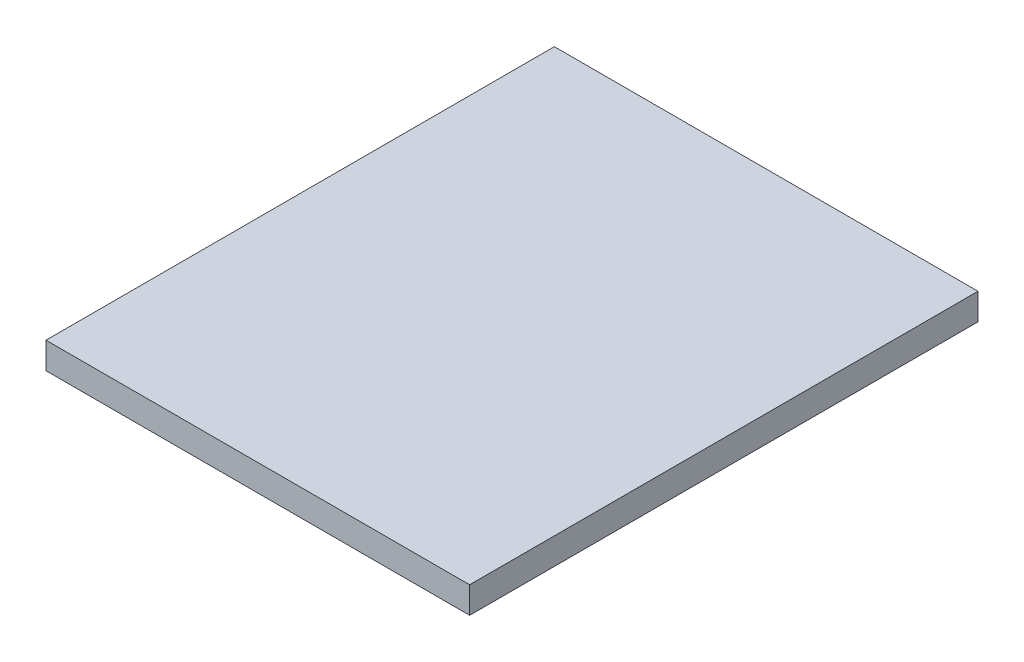
ISO-10303-21;
HEADER;
FILE_DESCRIPTION(('STEP AP214'),'2;1');
FILE_NAME('part.step','',(''),(''),'','','');
FILE_SCHEMA(('AUTOMOTIVE_DESIGN { 1 0 10303 214 1 1 1 1 }'));
ENDSEC;
DATA;
#1=APPLICATION_CONTEXT('core data for automotive mechanical design processes');
#2=APPLICATION_PROTOCOL_DEFINITION('international standard','automotive_design',2000,#1);
#3=PRODUCT_CONTEXT('',#1,'mechanical');
#4=PRODUCT('Part','Part','',(#3));
#5=PRODUCT_RELATED_PRODUCT_CATEGORY('part','',(#4));
#6=PRODUCT_DEFINITION_FORMATION('','',#4);
#7=PRODUCT_DEFINITION_CONTEXT('part definition',#1,'design');
#8=PRODUCT_DEFINITION('design','',#6,#7);
#9=PRODUCT_DEFINITION_SHAPE('','',#8);
#10=(LENGTH_UNIT() NAMED_UNIT(*) SI_UNIT(.MILLI.,.METRE.));
#11=(NAMED_UNIT(*) PLANE_ANGLE_UNIT() SI_UNIT($,.RADIAN.));
#12=(NAMED_UNIT(*) SI_UNIT($,.STERADIAN.) SOLID_ANGLE_UNIT());
#13=UNCERTAINTY_MEASURE_WITH_UNIT(LENGTH_MEASURE(1.E-05),#10,'distance_accuracy_value','');
#14=(GEOMETRIC_REPRESENTATION_CONTEXT(3) GLOBAL_UNCERTAINTY_ASSIGNED_CONTEXT((#13)) GLOBAL_UNIT_ASSIGNED_CONTEXT((#10,
#11,#12)) REPRESENTATION_CONTEXT('',''));
#15=CARTESIAN_POINT('',(0.,0.,0.));
#16=DIRECTION('',(0.,0.,1.));
#17=DIRECTION('',(1.,0.,0.));
#18=AXIS2_PLACEMENT_3D('',#15,#16,#17);
#19=CARTESIAN_POINT('',(-47.2248053535091,3.175,-34.5899444558873));
#20=DIRECTION('',(1.,0.,0.));
#21=DIRECTION('',(0.,0.,-1.));
#22=AXIS2_PLACEMENT_3D('',#19,#20,#21);
#23=PLANE('',#22);
#24=DIRECTION('',(0.,0.,1.));
#25=VECTOR('',#24,1.);
#26=CARTESIAN_POINT('',(-47.2248053535091,0.,-34.5899444558873));
#27=LINE('',#26,#25);
#28=CARTESIAN_POINT('',(-47.2248053535091,0.,-34.5899444558873));
#29=VERTEX_POINT('',#28);
#30=CARTESIAN_POINT('',(-47.2248053535091,0.,26.3700555441127));
#31=VERTEX_POINT('',#30);
#32=EDGE_CURVE('E96',#29,#31,#27,.T.);
#33=ORIENTED_EDGE('',*,*,#32,.T.);
#34=DIRECTION('',(0.,-1.,0.));
#35=VECTOR('',#34,1.);
#36=CARTESIAN_POINT('',(-47.2248053535091,3.175,26.3700555441127));
#37=LINE('',#36,#35);
#38=CARTESIAN_POINT('',(-47.2248053535091,3.175,26.3700555441127));
#39=VERTEX_POINT('',#38);
#40=EDGE_CURVE('E11',#39,#31,#37,.T.);
#41=ORIENTED_EDGE('',*,*,#40,.F.);
#42=DIRECTION('',(0.,0.,1.));
#43=VECTOR('',#42,1.);
#44=CARTESIAN_POINT('',(-47.2248053535091,3.175,-34.5899444558873));
#45=LINE('',#44,#43);
#46=CARTESIAN_POINT('',(-47.2248053535091,3.175,-34.5899444558873));
#47=VERTEX_POINT('',#46);
#48=EDGE_CURVE('E84',#47,#39,#45,.T.);
#49=ORIENTED_EDGE('',*,*,#48,.F.);
#50=DIRECTION('',(0.,-1.,0.));
#51=VECTOR('',#50,1.);
#52=CARTESIAN_POINT('',(-47.2248053535091,3.175,-34.5899444558873));
#53=LINE('',#52,#51);
#54=EDGE_CURVE('E92',#47,#29,#53,.T.);
#55=ORIENTED_EDGE('',*,*,#54,.T.);
#56=EDGE_LOOP('',(#33,#41,#49,#55));
#57=FACE_BOUND('',#56,.T.);
#58=ADVANCED_FACE('F33',(#57),#23,.F.);
#59=CARTESIAN_POINT('',(-47.2248053535091,3.175,26.3700555441127));
#60=DIRECTION('',(0.,0.,-1.));
#61=DIRECTION('',(-1.,0.,0.));
#62=AXIS2_PLACEMENT_3D('',#59,#60,#61);
#63=PLANE('',#62);
#64=DIRECTION('',(1.,0.,0.));
#65=VECTOR('',#64,1.);
#66=CARTESIAN_POINT('',(-47.2248053535091,0.,26.3700555441127));
#67=LINE('',#66,#65);
#68=CARTESIAN_POINT('',(3.57519464649094,0.,26.3700555441127));
#69=VERTEX_POINT('',#68);
#70=EDGE_CURVE('E88',#31,#69,#67,.T.);
#71=ORIENTED_EDGE('',*,*,#70,.T.);
#72=DIRECTION('',(0.,-1.,0.));
#73=VECTOR('',#72,1.);
#74=CARTESIAN_POINT('',(3.57519464649094,3.175,26.3700555441127));
#75=LINE('',#74,#73);
#76=CARTESIAN_POINT('',(3.57519464649094,3.175,26.3700555441127));
#77=VERTEX_POINT('',#76);
#78=EDGE_CURVE('E41',#77,#69,#75,.T.);
#79=ORIENTED_EDGE('',*,*,#78,.F.);
#80=DIRECTION('',(1.,0.,0.));
#81=VECTOR('',#80,1.);
#82=CARTESIAN_POINT('',(-47.2248053535091,3.175,26.3700555441127));
#83=LINE('',#82,#81);
#84=EDGE_CURVE('E79',#39,#77,#83,.T.);
#85=ORIENTED_EDGE('',*,*,#84,.F.);
#86=ORIENTED_EDGE('',*,*,#40,.T.);
#87=EDGE_LOOP('',(#71,#79,#85,#86));
#88=FACE_BOUND('',#87,.T.);
#89=ADVANCED_FACE('F87',(#88),#63,.F.);
#90=CARTESIAN_POINT('',(3.57519464649093,3.175,-34.5899444558873));
#91=DIRECTION('',(-1.,0.,0.));
#92=DIRECTION('',(0.,0.,1.));
#93=AXIS2_PLACEMENT_3D('',#90,#91,#92);
#94=PLANE('',#93);
#95=DIRECTION('',(0.,0.,-1.));
#96=VECTOR('',#95,1.);
#97=CARTESIAN_POINT('',(3.57519464649093,0.,-34.5899444558873));
#98=LINE('',#97,#96);
#99=CARTESIAN_POINT('',(3.57519464649093,0.,-34.5899444558873));
#100=VERTEX_POINT('',#99);
#101=EDGE_CURVE('E66',#69,#100,#98,.T.);
#102=ORIENTED_EDGE('',*,*,#101,.T.);
#103=DIRECTION('',(0.,-1.,0.));
#104=VECTOR('',#103,1.);
#105=CARTESIAN_POINT('',(3.57519464649093,3.175,-34.5899444558873));
#106=LINE('',#105,#104);
#107=CARTESIAN_POINT('',(3.57519464649093,3.175,-34.5899444558873));
#108=VERTEX_POINT('',#107);
#109=EDGE_CURVE('E89',#108,#100,#106,.T.);
#110=ORIENTED_EDGE('',*,*,#109,.F.);
#111=DIRECTION('',(0.,0.,-1.));
#112=VECTOR('',#111,1.);
#113=CARTESIAN_POINT('',(3.57519464649093,3.175,-34.5899444558873));
#114=LINE('',#113,#112);
#115=EDGE_CURVE('E82',#77,#108,#114,.T.);
#116=ORIENTED_EDGE('',*,*,#115,.F.);
#117=ORIENTED_EDGE('',*,*,#78,.T.);
#118=EDGE_LOOP('',(#102,#110,#116,#117));
#119=FACE_BOUND('',#118,.T.);
#120=ADVANCED_FACE('F90',(#119),#94,.F.);
#121=CARTESIAN_POINT('',(-47.2248053535091,3.175,-34.5899444558873));
#122=DIRECTION('',(0.,0.,1.));
#123=DIRECTION('',(1.,0.,0.));
#124=AXIS2_PLACEMENT_3D('',#121,#122,#123);
#125=PLANE('',#124);
#126=DIRECTION('',(-1.,0.,0.));
#127=VECTOR('',#126,1.);
#128=CARTESIAN_POINT('',(-47.2248053535091,0.,-34.5899444558873));
#129=LINE('',#128,#127);
#130=EDGE_CURVE('E72',#100,#29,#129,.T.);
#131=ORIENTED_EDGE('',*,*,#130,.T.);
#132=ORIENTED_EDGE('',*,*,#54,.F.);
#133=DIRECTION('',(-1.,0.,0.));
#134=VECTOR('',#133,1.);
#135=CARTESIAN_POINT('',(-47.2248053535091,3.175,-34.5899444558873));
#136=LINE('',#135,#134);
#137=EDGE_CURVE('E49',#108,#47,#136,.T.);
#138=ORIENTED_EDGE('',*,*,#137,.F.);
#139=ORIENTED_EDGE('',*,*,#109,.T.);
#140=EDGE_LOOP('',(#131,#132,#138,#139));
#141=FACE_BOUND('',#140,.T.);
#142=ADVANCED_FACE('F103',(#141),#125,.F.);
#143=CARTESIAN_POINT('',(-47.2248053535091,3.175,26.3700555441127));
#144=DIRECTION('',(0.,1.,0.));
#145=DIRECTION('',(0.,0.,1.));
#146=AXIS2_PLACEMENT_3D('',#143,#144,#145);
#147=PLANE('',#146);
#148=ORIENTED_EDGE('',*,*,#48,.T.);
#149=ORIENTED_EDGE('',*,*,#84,.T.);
#150=ORIENTED_EDGE('',*,*,#115,.T.);
#151=ORIENTED_EDGE('',*,*,#137,.T.);
#152=EDGE_LOOP('',(#148,#149,#150,#151));
#153=FACE_BOUND('',#152,.T.);
#154=ADVANCED_FACE('F80',(#153),#147,.T.);
#155=CARTESIAN_POINT('',(-47.2248053535091,0.,26.3700555441127));
#156=DIRECTION('',(0.,1.,0.));
#157=DIRECTION('',(0.,0.,1.));
#158=AXIS2_PLACEMENT_3D('',#155,#156,#157);
#159=PLANE('',#158);
#160=ORIENTED_EDGE('',*,*,#32,.F.);
#161=ORIENTED_EDGE('',*,*,#130,.F.);
#162=ORIENTED_EDGE('',*,*,#101,.F.);
#163=ORIENTED_EDGE('',*,*,#70,.F.);
#164=EDGE_LOOP('',(#160,#161,#162,#163));
#165=FACE_BOUND('',#164,.T.);
#166=ADVANCED_FACE('F106',(#165),#159,.F.);
#167=CLOSED_SHELL('',(#58,#89,#120,#142,#154,#166));
#168=MANIFOLD_SOLID_BREP('B2',#167);
#169=ADVANCED_BREP_SHAPE_REPRESENTATION('',(#18,#168),#14);
#170=SHAPE_DEFINITION_REPRESENTATION(#9,#169);
ENDSEC;
END-ISO-10303-21;
